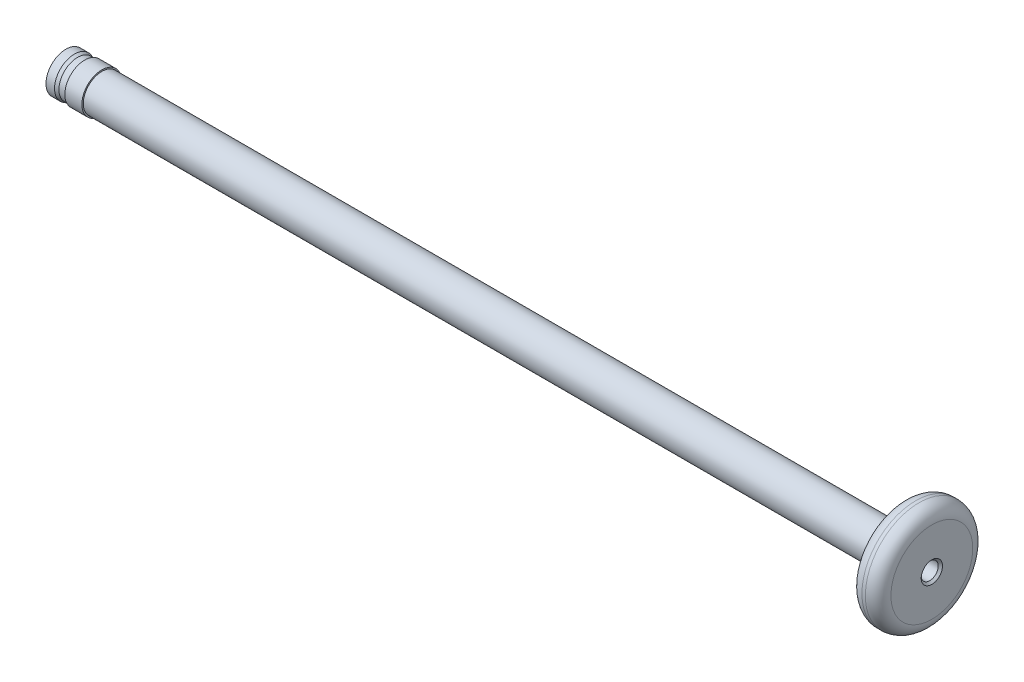
ISO-10303-21;
HEADER;
FILE_DESCRIPTION(('STEP AP214'),'2;1');
FILE_NAME('part.step','',(''),(''),'','','');
FILE_SCHEMA(('AUTOMOTIVE_DESIGN { 1 0 10303 214 1 1 1 1 }'));
ENDSEC;
DATA;
#1=APPLICATION_CONTEXT('core data for automotive mechanical design processes');
#2=APPLICATION_PROTOCOL_DEFINITION('international standard','automotive_design',2000,#1);
#3=PRODUCT_CONTEXT('',#1,'mechanical');
#4=PRODUCT('Part','Part','',(#3));
#5=PRODUCT_RELATED_PRODUCT_CATEGORY('part','',(#4));
#6=PRODUCT_DEFINITION_FORMATION('','',#4);
#7=PRODUCT_DEFINITION_CONTEXT('part definition',#1,'design');
#8=PRODUCT_DEFINITION('design','',#6,#7);
#9=PRODUCT_DEFINITION_SHAPE('','',#8);
#10=(LENGTH_UNIT() NAMED_UNIT(*) SI_UNIT(.MILLI.,.METRE.));
#11=(NAMED_UNIT(*) PLANE_ANGLE_UNIT() SI_UNIT($,.RADIAN.));
#12=(NAMED_UNIT(*) SI_UNIT($,.STERADIAN.) SOLID_ANGLE_UNIT());
#13=UNCERTAINTY_MEASURE_WITH_UNIT(LENGTH_MEASURE(1.E-05),#10,'distance_accuracy_value','');
#14=(GEOMETRIC_REPRESENTATION_CONTEXT(3) GLOBAL_UNCERTAINTY_ASSIGNED_CONTEXT((#13)) GLOBAL_UNIT_ASSIGNED_CONTEXT((#10,
#11,#12)) REPRESENTATION_CONTEXT('',''));
#15=CARTESIAN_POINT('',(0.,0.,0.));
#16=DIRECTION('',(0.,0.,1.));
#17=DIRECTION('',(1.,0.,0.));
#18=AXIS2_PLACEMENT_3D('',#15,#16,#17);
#19=CARTESIAN_POINT('',(-50.8,2.185,0.));
#20=DIRECTION('',(1.,0.,0.));
#21=DIRECTION('',(0.,1.,0.));
#22=AXIS2_PLACEMENT_3D('',#19,#20,#21);
#23=PLANE('',#22);
#24=CARTESIAN_POINT('',(-50.8,0.,0.));
#25=DIRECTION('',(-1.,0.,0.));
#26=DIRECTION('',(0.,-1.,0.));
#27=AXIS2_PLACEMENT_3D('',#24,#25,#26);
#28=CIRCLE('',#27,2.185);
#29=CARTESIAN_POINT('',(-50.8,-2.185,0.));
#30=VERTEX_POINT('',#29);
#31=EDGE_CURVE('E82',#30,#30,#28,.T.);
#32=ORIENTED_EDGE('',*,*,#31,.T.);
#33=EDGE_LOOP('',(#32));
#34=FACE_BOUND('',#33,.T.);
#35=ADVANCED_FACE('F32',(#34),#23,.F.);
#36=CARTESIAN_POINT('',(50.8,0.,0.));
#37=DIRECTION('',(-1.,0.,0.));
#38=DIRECTION('',(0.,-1.,0.));
#39=AXIS2_PLACEMENT_3D('',#36,#37,#38);
#40=PLANE('',#39);
#41=CARTESIAN_POINT('',(50.8,0.,0.));
#42=DIRECTION('',(-1.,0.,0.));
#43=DIRECTION('',(0.,-1.,0.));
#44=AXIS2_PLACEMENT_3D('',#41,#42,#43);
#45=CIRCLE('',#44,1.25);
#46=CARTESIAN_POINT('',(50.8,-1.25,0.));
#47=VERTEX_POINT('',#46);
#48=EDGE_CURVE('E10',#47,#47,#45,.T.);
#49=ORIENTED_EDGE('',*,*,#48,.T.);
#50=EDGE_LOOP('',(#49));
#51=FACE_BOUND('',#50,.T.);
#52=CARTESIAN_POINT('',(50.8,0.,0.));
#53=DIRECTION('',(-1.,0.,0.));
#54=DIRECTION('',(0.,-1.,0.));
#55=AXIS2_PLACEMENT_3D('',#52,#53,#54);
#56=CIRCLE('',#55,4.8);
#57=CARTESIAN_POINT('',(50.8,-4.8,0.));
#58=VERTEX_POINT('',#57);
#59=EDGE_CURVE('E43',#58,#58,#56,.F.);
#60=ORIENTED_EDGE('',*,*,#59,.T.);
#61=EDGE_LOOP('',(#60));
#62=FACE_BOUND('',#61,.T.);
#63=ADVANCED_FACE('F105',(#51,#62),#40,.F.);
#64=CARTESIAN_POINT('',(-50.8,0.,0.));
#65=DIRECTION('',(-1.,0.,0.));
#66=DIRECTION('',(0.,-1.,0.));
#67=AXIS2_PLACEMENT_3D('',#64,#65,#66);
#68=CYLINDRICAL_SURFACE('',#67,6.3);
#69=CARTESIAN_POINT('',(48.9,0.,0.));
#70=DIRECTION('',(1.,0.,0.));
#71=DIRECTION('',(0.,1.,0.));
#72=AXIS2_PLACEMENT_3D('',#69,#70,#71);
#73=CIRCLE('',#72,6.3);
#74=CARTESIAN_POINT('',(48.9,6.3,0.));
#75=VERTEX_POINT('',#74);
#76=EDGE_CURVE('E47',#75,#75,#73,.T.);
#77=ORIENTED_EDGE('',*,*,#76,.T.);
#78=EDGE_LOOP('',(#77));
#79=FACE_BOUND('',#78,.T.);
#80=CARTESIAN_POINT('',(49.3,0.,0.));
#81=DIRECTION('',(-1.,0.,0.));
#82=DIRECTION('',(0.,-1.,0.));
#83=AXIS2_PLACEMENT_3D('',#80,#81,#82);
#84=CIRCLE('',#83,6.3);
#85=CARTESIAN_POINT('',(49.3,-6.3,0.));
#86=VERTEX_POINT('',#85);
#87=EDGE_CURVE('E52',#86,#86,#84,.T.);
#88=ORIENTED_EDGE('',*,*,#87,.T.);
#89=EDGE_LOOP('',(#88));
#90=FACE_BOUND('',#89,.T.);
#91=ADVANCED_FACE('F111',(#79,#90),#68,.T.);
#92=CARTESIAN_POINT('',(47.4,2.185,0.));
#93=DIRECTION('',(1.,0.,0.));
#94=DIRECTION('',(0.,1.,0.));
#95=AXIS2_PLACEMENT_3D('',#92,#93,#94);
#96=PLANE('',#95);
#97=CARTESIAN_POINT('',(47.4,0.,0.));
#98=DIRECTION('',(1.,0.,0.));
#99=DIRECTION('',(0.,1.,0.));
#100=AXIS2_PLACEMENT_3D('',#97,#98,#99);
#101=CIRCLE('',#100,4.8);
#102=CARTESIAN_POINT('',(47.4,4.8,0.));
#103=VERTEX_POINT('',#102);
#104=EDGE_CURVE('E55',#103,#103,#101,.F.);
#105=ORIENTED_EDGE('',*,*,#104,.T.);
#106=EDGE_LOOP('',(#105));
#107=FACE_BOUND('',#106,.T.);
#108=CARTESIAN_POINT('',(47.4,0.,0.));
#109=DIRECTION('',(-1.,0.,0.));
#110=DIRECTION('',(0.,-1.,0.));
#111=AXIS2_PLACEMENT_3D('',#108,#109,#110);
#112=CIRCLE('',#111,2.185);
#113=CARTESIAN_POINT('',(47.4,-2.185,0.));
#114=VERTEX_POINT('',#113);
#115=EDGE_CURVE('E58',#114,#114,#112,.T.);
#116=ORIENTED_EDGE('',*,*,#115,.F.);
#117=EDGE_LOOP('',(#116));
#118=FACE_BOUND('',#117,.T.);
#119=ADVANCED_FACE('F129',(#107,#118),#96,.F.);
#120=CARTESIAN_POINT('',(-50.8,0.,0.));
#121=DIRECTION('',(-1.,0.,0.));
#122=DIRECTION('',(0.,-1.,0.));
#123=AXIS2_PLACEMENT_3D('',#120,#121,#122);
#124=CYLINDRICAL_SURFACE('',#123,2.185);
#125=CARTESIAN_POINT('',(-46.5637534009422,0.,0.));
#126=DIRECTION('',(-1.,0.,0.));
#127=DIRECTION('',(0.,-1.,0.));
#128=AXIS2_PLACEMENT_3D('',#125,#126,#127);
#129=CIRCLE('',#128,2.185);
#130=CARTESIAN_POINT('',(-46.5637534009422,-2.185,0.));
#131=VERTEX_POINT('',#130);
#132=EDGE_CURVE('E61',#131,#131,#129,.T.);
#133=ORIENTED_EDGE('',*,*,#132,.F.);
#134=EDGE_LOOP('',(#133));
#135=FACE_BOUND('',#134,.T.);
#136=ORIENTED_EDGE('',*,*,#115,.T.);
#137=EDGE_LOOP('',(#136));
#138=FACE_BOUND('',#137,.T.);
#139=ADVANCED_FACE('F134',(#135,#138),#124,.T.);
#140=CARTESIAN_POINT('',(-46.5637534009422,0.,0.));
#141=DIRECTION('',(-1.,0.,0.));
#142=DIRECTION('',(0.,-1.,0.));
#143=AXIS2_PLACEMENT_3D('',#140,#141,#142);
#144=CONICAL_SURFACE('',#143,2.185,1.48352986419521);
#145=CARTESIAN_POINT('',(-46.5768767004711,0.,0.));
#146=DIRECTION('',(-1.,0.,0.));
#147=DIRECTION('',(0.,-1.,0.));
#148=AXIS2_PLACEMENT_3D('',#145,#146,#147);
#149=CIRCLE('',#148,2.335);
#150=CARTESIAN_POINT('',(-46.5768767004711,-2.335,0.));
#151=VERTEX_POINT('',#150);
#152=EDGE_CURVE('E64',#151,#151,#149,.T.);
#153=ORIENTED_EDGE('',*,*,#152,.F.);
#154=EDGE_LOOP('',(#153));
#155=FACE_BOUND('',#154,.T.);
#156=ORIENTED_EDGE('',*,*,#132,.T.);
#157=EDGE_LOOP('',(#156));
#158=FACE_BOUND('',#157,.T.);
#159=ADVANCED_FACE('F140',(#155,#158),#144,.T.);
#160=CARTESIAN_POINT('',(-50.8,0.,0.));
#161=DIRECTION('',(-1.,0.,0.));
#162=DIRECTION('',(0.,-1.,0.));
#163=AXIS2_PLACEMENT_3D('',#160,#161,#162);
#164=CYLINDRICAL_SURFACE('',#163,2.335);
#165=CARTESIAN_POINT('',(-48.5768767004711,0.,0.));
#166=DIRECTION('',(-1.,0.,0.));
#167=DIRECTION('',(0.,-1.,0.));
#168=AXIS2_PLACEMENT_3D('',#165,#166,#167);
#169=CIRCLE('',#168,2.335);
#170=CARTESIAN_POINT('',(-48.5768767004711,-2.335,0.));
#171=VERTEX_POINT('',#170);
#172=EDGE_CURVE('E67',#171,#171,#169,.T.);
#173=ORIENTED_EDGE('',*,*,#172,.F.);
#174=EDGE_LOOP('',(#173));
#175=FACE_BOUND('',#174,.T.);
#176=ORIENTED_EDGE('',*,*,#152,.T.);
#177=EDGE_LOOP('',(#176));
#178=FACE_BOUND('',#177,.T.);
#179=ADVANCED_FACE('F144',(#175,#178),#164,.T.);
#180=CARTESIAN_POINT('',(-48.5768767004711,0.,0.));
#181=DIRECTION('',(1.,0.,0.));
#182=DIRECTION('',(0.,1.,0.));
#183=AXIS2_PLACEMENT_3D('',#180,#181,#182);
#184=CONICAL_SURFACE('',#183,2.335,1.48352986419521);
#185=CARTESIAN_POINT('',(-48.59,0.,0.));
#186=DIRECTION('',(-1.,0.,0.));
#187=DIRECTION('',(0.,-1.,0.));
#188=AXIS2_PLACEMENT_3D('',#185,#186,#187);
#189=CIRCLE('',#188,2.185);
#190=CARTESIAN_POINT('',(-48.59,-2.185,0.));
#191=VERTEX_POINT('',#190);
#192=EDGE_CURVE('E70',#191,#191,#189,.T.);
#193=ORIENTED_EDGE('',*,*,#192,.F.);
#194=EDGE_LOOP('',(#193));
#195=FACE_BOUND('',#194,.T.);
#196=ORIENTED_EDGE('',*,*,#172,.T.);
#197=EDGE_LOOP('',(#196));
#198=FACE_BOUND('',#197,.T.);
#199=ADVANCED_FACE('F148',(#195,#198),#184,.T.);
#200=CARTESIAN_POINT('',(-50.8,0.,0.));
#201=DIRECTION('',(-1.,0.,0.));
#202=DIRECTION('',(0.,-1.,0.));
#203=AXIS2_PLACEMENT_3D('',#200,#201,#202);
#204=CYLINDRICAL_SURFACE('',#203,2.185);
#205=CARTESIAN_POINT('',(-49.42,0.,0.));
#206=DIRECTION('',(-1.,0.,0.));
#207=DIRECTION('',(0.,-1.,0.));
#208=AXIS2_PLACEMENT_3D('',#205,#206,#207);
#209=CIRCLE('',#208,2.185);
#210=CARTESIAN_POINT('',(-49.42,-2.185,0.));
#211=VERTEX_POINT('',#210);
#212=EDGE_CURVE('E73',#211,#211,#209,.T.);
#213=ORIENTED_EDGE('',*,*,#212,.F.);
#214=EDGE_LOOP('',(#213));
#215=FACE_BOUND('',#214,.T.);
#216=ORIENTED_EDGE('',*,*,#192,.T.);
#217=EDGE_LOOP('',(#216));
#218=FACE_BOUND('',#217,.T.);
#219=ADVANCED_FACE('F152',(#215,#218),#204,.T.);
#220=CARTESIAN_POINT('',(-49.42,0.,0.));
#221=DIRECTION('',(-1.,0.,0.));
#222=DIRECTION('',(0.,-1.,0.));
#223=AXIS2_PLACEMENT_3D('',#220,#221,#222);
#224=CONICAL_SURFACE('',#223,2.185,0.388118076356509);
#225=CARTESIAN_POINT('',(-49.7868767004711,0.,0.));
#226=DIRECTION('',(-1.,0.,0.));
#227=DIRECTION('',(0.,-1.,0.));
#228=AXIS2_PLACEMENT_3D('',#225,#226,#227);
#229=CIRCLE('',#228,2.335);
#230=CARTESIAN_POINT('',(-49.7868767004711,-2.335,0.));
#231=VERTEX_POINT('',#230);
#232=EDGE_CURVE('E76',#231,#231,#229,.T.);
#233=ORIENTED_EDGE('',*,*,#232,.F.);
#234=EDGE_LOOP('',(#233));
#235=FACE_BOUND('',#234,.T.);
#236=ORIENTED_EDGE('',*,*,#212,.T.);
#237=EDGE_LOOP('',(#236));
#238=FACE_BOUND('',#237,.T.);
#239=ADVANCED_FACE('F156',(#235,#238),#224,.T.);
#240=CARTESIAN_POINT('',(-50.8,0.,0.));
#241=DIRECTION('',(-1.,0.,0.));
#242=DIRECTION('',(0.,-1.,0.));
#243=AXIS2_PLACEMENT_3D('',#240,#241,#242);
#244=CYLINDRICAL_SURFACE('',#243,2.335);
#245=CARTESIAN_POINT('',(-50.7868767004711,0.,0.));
#246=DIRECTION('',(-1.,0.,0.));
#247=DIRECTION('',(0.,-1.,0.));
#248=AXIS2_PLACEMENT_3D('',#245,#246,#247);
#249=CIRCLE('',#248,2.335);
#250=CARTESIAN_POINT('',(-50.7868767004711,-2.335,0.));
#251=VERTEX_POINT('',#250);
#252=EDGE_CURVE('E79',#251,#251,#249,.T.);
#253=ORIENTED_EDGE('',*,*,#252,.F.);
#254=EDGE_LOOP('',(#253));
#255=FACE_BOUND('',#254,.T.);
#256=ORIENTED_EDGE('',*,*,#232,.T.);
#257=EDGE_LOOP('',(#256));
#258=FACE_BOUND('',#257,.T.);
#259=ADVANCED_FACE('F101',(#255,#258),#244,.T.);
#260=CARTESIAN_POINT('',(-50.7868767004711,0.,0.));
#261=DIRECTION('',(1.,0.,0.));
#262=DIRECTION('',(0.,1.,0.));
#263=AXIS2_PLACEMENT_3D('',#260,#261,#262);
#264=CONICAL_SURFACE('',#263,2.335,1.48352986419521);
#265=ORIENTED_EDGE('',*,*,#31,.F.);
#266=EDGE_LOOP('',(#265));
#267=FACE_BOUND('',#266,.T.);
#268=ORIENTED_EDGE('',*,*,#252,.T.);
#269=EDGE_LOOP('',(#268));
#270=FACE_BOUND('',#269,.T.);
#271=ADVANCED_FACE('F93',(#267,#270),#264,.T.);
#272=CARTESIAN_POINT('',(45.8,0.,0.));
#273=DIRECTION('',(1.,0.,0.));
#274=DIRECTION('',(0.,1.,0.));
#275=AXIS2_PLACEMENT_3D('',#272,#273,#274);
#276=CYLINDRICAL_SURFACE('',#275,1.);
#277=CARTESIAN_POINT('',(50.55,0.,0.));
#278=DIRECTION('',(-1.,0.,0.));
#279=DIRECTION('',(0.,-1.,0.));
#280=AXIS2_PLACEMENT_3D('',#277,#278,#279);
#281=CIRCLE('',#280,1.);
#282=CARTESIAN_POINT('',(50.55,-1.,0.));
#283=VERTEX_POINT('',#282);
#284=EDGE_CURVE('E39',#283,#283,#281,.F.);
#285=ORIENTED_EDGE('',*,*,#284,.T.);
#286=EDGE_LOOP('',(#285));
#287=FACE_BOUND('',#286,.T.);
#288=CARTESIAN_POINT('',(45.8,0.,0.));
#289=DIRECTION('',(1.,0.,0.));
#290=DIRECTION('',(0.,1.,0.));
#291=AXIS2_PLACEMENT_3D('',#288,#289,#290);
#292=CIRCLE('',#291,1.);
#293=CARTESIAN_POINT('',(45.8,1.,0.));
#294=VERTEX_POINT('',#293);
#295=EDGE_CURVE('E85',#294,#294,#292,.T.);
#296=ORIENTED_EDGE('',*,*,#295,.F.);
#297=EDGE_LOOP('',(#296));
#298=FACE_BOUND('',#297,.T.);
#299=ADVANCED_FACE('F91',(#287,#298),#276,.F.);
#300=CARTESIAN_POINT('',(45.8,0.,0.));
#301=DIRECTION('',(1.,0.,0.));
#302=DIRECTION('',(0.,1.,0.));
#303=AXIS2_PLACEMENT_3D('',#300,#301,#302);
#304=PLANE('',#303);
#305=ORIENTED_EDGE('',*,*,#295,.T.);
#306=EDGE_LOOP('',(#305));
#307=FACE_BOUND('',#306,.T.);
#308=ADVANCED_FACE('F89',(#307),#304,.T.);
#309=CARTESIAN_POINT('',(48.9,0.,0.));
#310=DIRECTION('',(1.,0.,0.));
#311=DIRECTION('',(0.,1.,0.));
#312=AXIS2_PLACEMENT_3D('',#309,#310,#311);
#313=TOROIDAL_SURFACE('',#312,4.8,1.5);
#314=ORIENTED_EDGE('',*,*,#76,.F.);
#315=EDGE_LOOP('',(#314));
#316=FACE_BOUND('',#315,.T.);
#317=ORIENTED_EDGE('',*,*,#104,.F.);
#318=EDGE_LOOP('',(#317));
#319=FACE_BOUND('',#318,.T.);
#320=ADVANCED_FACE('F99',(#316,#319),#313,.T.);
#321=CARTESIAN_POINT('',(49.3,0.,0.));
#322=DIRECTION('',(-1.,0.,0.));
#323=DIRECTION('',(0.,-1.,0.));
#324=AXIS2_PLACEMENT_3D('',#321,#322,#323);
#325=TOROIDAL_SURFACE('',#324,4.8,1.5);
#326=ORIENTED_EDGE('',*,*,#59,.F.);
#327=EDGE_LOOP('',(#326));
#328=FACE_BOUND('',#327,.T.);
#329=ORIENTED_EDGE('',*,*,#87,.F.);
#330=EDGE_LOOP('',(#329));
#331=FACE_BOUND('',#330,.T.);
#332=ADVANCED_FACE('F116',(#328,#331),#325,.T.);
#333=CARTESIAN_POINT('',(50.55,0.,0.));
#334=DIRECTION('',(1.,0.,0.));
#335=DIRECTION('',(0.,1.,0.));
#336=AXIS2_PLACEMENT_3D('',#333,#334,#335);
#337=CONICAL_SURFACE('',#336,1.,0.785398163397422);
#338=ORIENTED_EDGE('',*,*,#48,.F.);
#339=EDGE_LOOP('',(#338));
#340=FACE_BOUND('',#339,.T.);
#341=ORIENTED_EDGE('',*,*,#284,.F.);
#342=EDGE_LOOP('',(#341));
#343=FACE_BOUND('',#342,.T.);
#344=ADVANCED_FACE('F34',(#340,#343),#337,.F.);
#345=CLOSED_SHELL('',(#35,#63,#91,#119,#139,#159,#179,#199,#219,#239,#259,#271,#299,#308,#320,
#332,#344));
#346=MANIFOLD_SOLID_BREP('B2',#345);
#347=ADVANCED_BREP_SHAPE_REPRESENTATION('',(#18,#346),#14);
#348=SHAPE_DEFINITION_REPRESENTATION(#9,#347);
ENDSEC;
END-ISO-10303-21;
